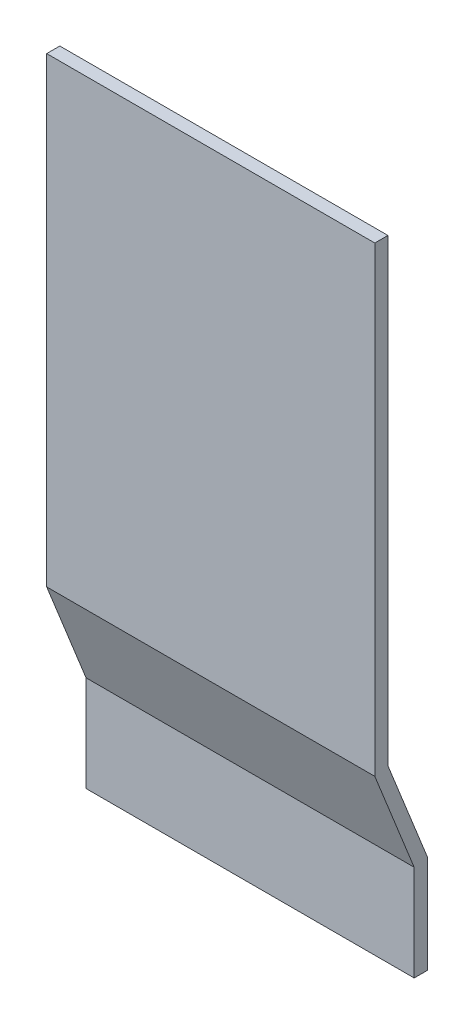
ISO-10303-21;
HEADER;
FILE_DESCRIPTION(('STEP AP214'),'2;1');
FILE_NAME('part.step','',(''),(''),'','','');
FILE_SCHEMA(('AUTOMOTIVE_DESIGN { 1 0 10303 214 1 1 1 1 }'));
ENDSEC;
DATA;
#1=APPLICATION_CONTEXT('core data for automotive mechanical design processes');
#2=APPLICATION_PROTOCOL_DEFINITION('international standard','automotive_design',2000,#1);
#3=PRODUCT_CONTEXT('',#1,'mechanical');
#4=PRODUCT('Part','Part','',(#3));
#5=PRODUCT_RELATED_PRODUCT_CATEGORY('part','',(#4));
#6=PRODUCT_DEFINITION_FORMATION('','',#4);
#7=PRODUCT_DEFINITION_CONTEXT('part definition',#1,'design');
#8=PRODUCT_DEFINITION('design','',#6,#7);
#9=PRODUCT_DEFINITION_SHAPE('','',#8);
#10=(LENGTH_UNIT() NAMED_UNIT(*) SI_UNIT(.MILLI.,.METRE.));
#11=(NAMED_UNIT(*) PLANE_ANGLE_UNIT() SI_UNIT($,.RADIAN.));
#12=(NAMED_UNIT(*) SI_UNIT($,.STERADIAN.) SOLID_ANGLE_UNIT());
#13=UNCERTAINTY_MEASURE_WITH_UNIT(LENGTH_MEASURE(1.E-05),#10,'distance_accuracy_value','');
#14=(GEOMETRIC_REPRESENTATION_CONTEXT(3) GLOBAL_UNCERTAINTY_ASSIGNED_CONTEXT((#13)) GLOBAL_UNIT_ASSIGNED_CONTEXT((#10,
#11,#12)) REPRESENTATION_CONTEXT('',''));
#15=CARTESIAN_POINT('',(0.,0.,0.));
#16=DIRECTION('',(0.,0.,1.));
#17=DIRECTION('',(1.,0.,0.));
#18=AXIS2_PLACEMENT_3D('',#15,#16,#17);
#19=CARTESIAN_POINT('',(-22.37728245926,4.697980609798,-20.53448402181));
#20=DIRECTION('',(0.,0.,1.));
#21=DIRECTION('',(0.,-1.,0.));
#22=AXIS2_PLACEMENT_3D('',#19,#20,#21);
#23=PLANE('',#22);
#24=DIRECTION('',(1.,0.,0.));
#25=VECTOR('',#24,1.);
#26=CARTESIAN_POINT('',(-22.37728245926,4.697980609798,-20.53448402181));
#27=LINE('',#26,#25);
#28=CARTESIAN_POINT('',(-24.87728245926,4.697980609798,-20.53448402181));
#29=VERTEX_POINT('',#28);
#30=CARTESIAN_POINT('',(-22.37728245926,4.697980609798,-20.53448402181));
#31=VERTEX_POINT('',#30);
#32=EDGE_CURVE('E85',#29,#31,#27,.T.);
#33=ORIENTED_EDGE('',*,*,#32,.T.);
#34=DIRECTION('',(0.,-1.,0.));
#35=VECTOR('',#34,1.);
#36=CARTESIAN_POINT('',(-22.37728245926,4.697980609798,-20.53448402181));
#37=LINE('',#36,#35);
#38=CARTESIAN_POINT('',(-22.37728245926,3.947980609798,-20.53448402181));
#39=VERTEX_POINT('',#38);
#40=EDGE_CURVE('E20',#39,#31,#37,.F.);
#41=ORIENTED_EDGE('',*,*,#40,.F.);
#42=DIRECTION('',(1.,0.,0.));
#43=VECTOR('',#42,1.);
#44=CARTESIAN_POINT('',(-22.37728245926,3.947980609798,-20.53448402181));
#45=LINE('',#44,#43);
#46=CARTESIAN_POINT('',(-24.87728245926,3.947980609798,-20.53448402181));
#47=VERTEX_POINT('',#46);
#48=EDGE_CURVE('E83',#39,#47,#45,.F.);
#49=ORIENTED_EDGE('',*,*,#48,.T.);
#50=DIRECTION('',(0.,-1.,0.));
#51=VECTOR('',#50,1.);
#52=CARTESIAN_POINT('',(-24.87728245926,4.697980609798,-20.53448402181));
#53=LINE('',#52,#51);
#54=EDGE_CURVE('E76',#29,#47,#53,.T.);
#55=ORIENTED_EDGE('',*,*,#54,.F.);
#56=EDGE_LOOP('',(#33,#41,#49,#55));
#57=FACE_BOUND('',#56,.T.);
#58=ADVANCED_FACE('F17',(#57),#23,.F.);
#59=CARTESIAN_POINT('',(-22.37728245926,3.947980609798,-20.53448402181));
#60=DIRECTION('',(0.,1.,0.));
#61=DIRECTION('',(0.,0.,1.));
#62=AXIS2_PLACEMENT_3D('',#59,#60,#61);
#63=PLANE('',#62);
#64=ORIENTED_EDGE('',*,*,#48,.F.);
#65=DIRECTION('',(0.,0.,1.));
#66=VECTOR('',#65,1.);
#67=CARTESIAN_POINT('',(-22.37728245926,3.947980609798,-20.53448402181));
#68=LINE('',#67,#66);
#69=CARTESIAN_POINT('',(-22.37728245926,3.947980609798,-20.43448402181));
#70=VERTEX_POINT('',#69);
#71=EDGE_CURVE('E92',#70,#39,#68,.F.);
#72=ORIENTED_EDGE('',*,*,#71,.F.);
#73=DIRECTION('',(-1.,0.,0.));
#74=VECTOR('',#73,1.);
#75=CARTESIAN_POINT('',(-22.37728245926,3.947980609798,-20.43448402181));
#76=LINE('',#75,#74);
#77=CARTESIAN_POINT('',(-24.87728245926,3.947980609798,-20.43448402181));
#78=VERTEX_POINT('',#77);
#79=EDGE_CURVE('E108',#70,#78,#76,.T.);
#80=ORIENTED_EDGE('',*,*,#79,.T.);
#81=DIRECTION('',(0.,0.,1.));
#82=VECTOR('',#81,1.);
#83=CARTESIAN_POINT('',(-24.87728245926,3.947980609798,-20.53448402181));
#84=LINE('',#83,#82);
#85=EDGE_CURVE('E94',#47,#78,#84,.T.);
#86=ORIENTED_EDGE('',*,*,#85,.F.);
#87=EDGE_LOOP('',(#64,#72,#80,#86));
#88=FACE_BOUND('',#87,.T.);
#89=ADVANCED_FACE('F90',(#88),#63,.F.);
#90=CARTESIAN_POINT('',(-22.37728245926,5.447980609798,-20.23448402181));
#91=DIRECTION('',(0.,-0.371390676354104,0.928476690885259));
#92=DIRECTION('',(0.,-0.928476690885259,-0.371390676354104));
#93=AXIS2_PLACEMENT_3D('',#90,#91,#92);
#94=PLANE('',#93);
#95=DIRECTION('',(1.,0.,0.));
#96=VECTOR('',#95,1.);
#97=CARTESIAN_POINT('',(-22.37728245926,5.447980609798,-20.23448402181));
#98=LINE('',#97,#96);
#99=CARTESIAN_POINT('',(-24.87728245926,5.447980609798,-20.23448402181));
#100=VERTEX_POINT('',#99);
#101=CARTESIAN_POINT('',(-22.37728245926,5.447980609798,-20.23448402181));
#102=VERTEX_POINT('',#101);
#103=EDGE_CURVE('E112',#100,#102,#98,.T.);
#104=ORIENTED_EDGE('',*,*,#103,.T.);
#105=DIRECTION('',(0.,-0.928476690885259,-0.371390676354104));
#106=VECTOR('',#105,1.);
#107=CARTESIAN_POINT('',(-22.37728245926,5.447980609798,-20.23448402181));
#108=LINE('',#107,#106);
#109=EDGE_CURVE('E104',#31,#102,#108,.F.);
#110=ORIENTED_EDGE('',*,*,#109,.F.);
#111=ORIENTED_EDGE('',*,*,#32,.F.);
#112=DIRECTION('',(0.,-0.928476690885259,-0.371390676354104));
#113=VECTOR('',#112,1.);
#114=CARTESIAN_POINT('',(-24.87728245926,5.447980609798,-20.23448402181));
#115=LINE('',#114,#113);
#116=EDGE_CURVE('E106',#100,#29,#115,.T.);
#117=ORIENTED_EDGE('',*,*,#116,.F.);
#118=EDGE_LOOP('',(#104,#110,#111,#117));
#119=FACE_BOUND('',#118,.T.);
#120=ADVANCED_FACE('F177',(#119),#94,.F.);
#121=CARTESIAN_POINT('',(-22.37728245926,4.678722369441,-20.43448402181));
#122=DIRECTION('',(0.,0.,-1.));
#123=DIRECTION('',(-1.,0.,0.));
#124=AXIS2_PLACEMENT_3D('',#121,#122,#123);
#125=PLANE('',#124);
#126=ORIENTED_EDGE('',*,*,#79,.F.);
#127=DIRECTION('',(0.,1.,0.));
#128=VECTOR('',#127,1.);
#129=CARTESIAN_POINT('',(-22.37728245926,8.947980609798,-20.43448402181));
#130=LINE('',#129,#128);
#131=CARTESIAN_POINT('',(-22.37728245926,4.678722369441,-20.43448402181));
#132=VERTEX_POINT('',#131);
#133=EDGE_CURVE('E99',#132,#70,#130,.F.);
#134=ORIENTED_EDGE('',*,*,#133,.F.);
#135=DIRECTION('',(1.,0.,0.));
#136=VECTOR('',#135,1.);
#137=CARTESIAN_POINT('',(-22.37728245926,4.678722369441,-20.43448402181));
#138=LINE('',#137,#136);
#139=CARTESIAN_POINT('',(-24.87728245926,4.678722369441,-20.43448402181));
#140=VERTEX_POINT('',#139);
#141=EDGE_CURVE('E125',#132,#140,#138,.F.);
#142=ORIENTED_EDGE('',*,*,#141,.T.);
#143=DIRECTION('',(0.,1.,0.));
#144=VECTOR('',#143,1.);
#145=CARTESIAN_POINT('',(-24.87728245926,4.678722369441,-20.43448402181));
#146=LINE('',#145,#144);
#147=EDGE_CURVE('E110',#78,#140,#146,.T.);
#148=ORIENTED_EDGE('',*,*,#147,.F.);
#149=EDGE_LOOP('',(#126,#134,#142,#148));
#150=FACE_BOUND('',#149,.T.);
#151=ADVANCED_FACE('F173',(#150),#125,.F.);
#152=CARTESIAN_POINT('',(-22.37728245926,8.947980609798,-20.23448402181));
#153=DIRECTION('',(0.,0.,1.));
#154=DIRECTION('',(0.,-1.,0.));
#155=AXIS2_PLACEMENT_3D('',#152,#153,#154);
#156=PLANE('',#155);
#157=DIRECTION('',(1.,0.,0.));
#158=VECTOR('',#157,1.);
#159=CARTESIAN_POINT('',(-22.37728245926,8.947980609798,-20.23448402181));
#160=LINE('',#159,#158);
#161=CARTESIAN_POINT('',(-24.87728245926,8.947980609798,-20.23448402181));
#162=VERTEX_POINT('',#161);
#163=CARTESIAN_POINT('',(-22.37728245926,8.947980609798,-20.23448402181));
#164=VERTEX_POINT('',#163);
#165=EDGE_CURVE('E115',#162,#164,#160,.T.);
#166=ORIENTED_EDGE('',*,*,#165,.T.);
#167=DIRECTION('',(0.,1.,0.));
#168=VECTOR('',#167,1.);
#169=CARTESIAN_POINT('',(-22.37728245926,8.947980609798,-20.23448402181));
#170=LINE('',#169,#168);
#171=EDGE_CURVE('E120',#102,#164,#170,.T.);
#172=ORIENTED_EDGE('',*,*,#171,.F.);
#173=ORIENTED_EDGE('',*,*,#103,.F.);
#174=DIRECTION('',(0.,1.,0.));
#175=VECTOR('',#174,1.);
#176=CARTESIAN_POINT('',(-24.87728245926,8.947980609798,-20.23448402181));
#177=LINE('',#176,#175);
#178=EDGE_CURVE('E129',#100,#162,#177,.T.);
#179=ORIENTED_EDGE('',*,*,#178,.T.);
#180=EDGE_LOOP('',(#166,#172,#173,#179));
#181=FACE_BOUND('',#180,.T.);
#182=ADVANCED_FACE('F170',(#181),#156,.F.);
#183=CARTESIAN_POINT('',(-22.37728245926,8.947980609798,-20.23448402181));
#184=DIRECTION('',(0.,-1.,0.));
#185=DIRECTION('',(0.,0.,-1.));
#186=AXIS2_PLACEMENT_3D('',#183,#184,#185);
#187=PLANE('',#186);
#188=DIRECTION('',(-1.,0.,0.));
#189=VECTOR('',#188,1.);
#190=CARTESIAN_POINT('',(-22.37728245926,8.947980609798,-20.13448402181));
#191=LINE('',#190,#189);
#192=CARTESIAN_POINT('',(-24.87728245926,8.947980609798,-20.13448402181));
#193=VERTEX_POINT('',#192);
#194=CARTESIAN_POINT('',(-22.37728245926,8.947980609798,-20.13448402181));
#195=VERTEX_POINT('',#194);
#196=EDGE_CURVE('E135',#193,#195,#191,.F.);
#197=ORIENTED_EDGE('',*,*,#196,.T.);
#198=DIRECTION('',(0.,0.,-1.));
#199=VECTOR('',#198,1.);
#200=CARTESIAN_POINT('',(-22.37728245926,8.947980609798,-20.13448402181));
#201=LINE('',#200,#199);
#202=EDGE_CURVE('E117',#164,#195,#201,.F.);
#203=ORIENTED_EDGE('',*,*,#202,.F.);
#204=ORIENTED_EDGE('',*,*,#165,.F.);
#205=DIRECTION('',(0.,0.,-1.));
#206=VECTOR('',#205,1.);
#207=CARTESIAN_POINT('',(-24.87728245926,8.947980609798,-20.13448402181));
#208=LINE('',#207,#206);
#209=EDGE_CURVE('E132',#162,#193,#208,.F.);
#210=ORIENTED_EDGE('',*,*,#209,.T.);
#211=EDGE_LOOP('',(#197,#203,#204,#210));
#212=FACE_BOUND('',#211,.T.);
#213=ADVANCED_FACE('F152',(#212),#187,.F.);
#214=CARTESIAN_POINT('',(-22.37728245926,8.947980609798,-20.13448402181));
#215=DIRECTION('',(1.,0.,0.));
#216=DIRECTION('',(0.,0.,-1.));
#217=AXIS2_PLACEMENT_3D('',#214,#215,#216);
#218=PLANE('',#217);
#219=ORIENTED_EDGE('',*,*,#109,.T.);
#220=ORIENTED_EDGE('',*,*,#171,.T.);
#221=ORIENTED_EDGE('',*,*,#202,.T.);
#222=DIRECTION('',(0.,1.,0.));
#223=VECTOR('',#222,1.);
#224=CARTESIAN_POINT('',(-22.37728245926,8.947980609798,-20.13448402181));
#225=LINE('',#224,#223);
#226=CARTESIAN_POINT('',(-22.37728245926,5.428722369441,-20.13448402181));
#227=VERTEX_POINT('',#226);
#228=EDGE_CURVE('E138',#195,#227,#225,.F.);
#229=ORIENTED_EDGE('',*,*,#228,.T.);
#230=DIRECTION('',(0.,0.928476690885259,0.371390676354104));
#231=VECTOR('',#230,1.);
#232=CARTESIAN_POINT('',(-22.37728245926,5.428722369441,-20.13448402181));
#233=LINE('',#232,#231);
#234=EDGE_CURVE('E123',#227,#132,#233,.F.);
#235=ORIENTED_EDGE('',*,*,#234,.T.);
#236=ORIENTED_EDGE('',*,*,#133,.T.);
#237=ORIENTED_EDGE('',*,*,#71,.T.);
#238=ORIENTED_EDGE('',*,*,#40,.T.);
#239=EDGE_LOOP('',(#219,#220,#221,#229,#235,#236,#237,#238));
#240=FACE_BOUND('',#239,.T.);
#241=ADVANCED_FACE('F97',(#240),#218,.T.);
#242=CARTESIAN_POINT('',(-22.37728245926,5.428722369441,-20.13448402181));
#243=DIRECTION('',(0.,0.371390676354104,-0.928476690885259));
#244=DIRECTION('',(0.,0.928476690885259,0.371390676354104));
#245=AXIS2_PLACEMENT_3D('',#242,#243,#244);
#246=PLANE('',#245);
#247=ORIENTED_EDGE('',*,*,#141,.F.);
#248=ORIENTED_EDGE('',*,*,#234,.F.);
#249=DIRECTION('',(-1.,0.,0.));
#250=VECTOR('',#249,1.);
#251=CARTESIAN_POINT('',(-22.37728245926,5.428722369441,-20.13448402181));
#252=LINE('',#251,#250);
#253=CARTESIAN_POINT('',(-24.87728245926,5.428722369441,-20.13448402181));
#254=VERTEX_POINT('',#253);
#255=EDGE_CURVE('E26',#227,#254,#252,.T.);
#256=ORIENTED_EDGE('',*,*,#255,.T.);
#257=DIRECTION('',(0.,-0.928476690885259,-0.371390676354106));
#258=VECTOR('',#257,1.);
#259=CARTESIAN_POINT('',(-24.87728245926,5.428722369441,-20.13448402181));
#260=LINE('',#259,#258);
#261=EDGE_CURVE('E34',#254,#140,#260,.T.);
#262=ORIENTED_EDGE('',*,*,#261,.T.);
#263=EDGE_LOOP('',(#247,#248,#256,#262));
#264=FACE_BOUND('',#263,.T.);
#265=ADVANCED_FACE('F145',(#264),#246,.F.);
#266=CARTESIAN_POINT('',(-24.87728245926,8.947980609798,-20.13448402181));
#267=DIRECTION('',(1.,0.,0.));
#268=DIRECTION('',(0.,0.,-1.));
#269=AXIS2_PLACEMENT_3D('',#266,#267,#268);
#270=PLANE('',#269);
#271=ORIENTED_EDGE('',*,*,#178,.F.);
#272=ORIENTED_EDGE('',*,*,#116,.T.);
#273=ORIENTED_EDGE('',*,*,#54,.T.);
#274=ORIENTED_EDGE('',*,*,#85,.T.);
#275=ORIENTED_EDGE('',*,*,#147,.T.);
#276=ORIENTED_EDGE('',*,*,#261,.F.);
#277=DIRECTION('',(0.,1.,0.));
#278=VECTOR('',#277,1.);
#279=CARTESIAN_POINT('',(-24.87728245926,8.947980609798,-20.13448402181));
#280=LINE('',#279,#278);
#281=EDGE_CURVE('E11',#254,#193,#280,.T.);
#282=ORIENTED_EDGE('',*,*,#281,.T.);
#283=ORIENTED_EDGE('',*,*,#209,.F.);
#284=EDGE_LOOP('',(#271,#272,#273,#274,#275,#276,#282,#283));
#285=FACE_BOUND('',#284,.T.);
#286=ADVANCED_FACE('F155',(#285),#270,.F.);
#287=CARTESIAN_POINT('',(-22.37728245926,8.947980609798,-20.13448402181));
#288=DIRECTION('',(0.,0.,-1.));
#289=DIRECTION('',(-1.,0.,0.));
#290=AXIS2_PLACEMENT_3D('',#287,#288,#289);
#291=PLANE('',#290);
#292=ORIENTED_EDGE('',*,*,#255,.F.);
#293=ORIENTED_EDGE('',*,*,#228,.F.);
#294=ORIENTED_EDGE('',*,*,#196,.F.);
#295=ORIENTED_EDGE('',*,*,#281,.F.);
#296=EDGE_LOOP('',(#292,#293,#294,#295));
#297=FACE_BOUND('',#296,.T.);
#298=ADVANCED_FACE('F148',(#297),#291,.F.);
#299=CLOSED_SHELL('',(#58,#89,#120,#151,#182,#213,#241,#265,#286,#298));
#300=MANIFOLD_SOLID_BREP('B1',#299);
#301=ADVANCED_BREP_SHAPE_REPRESENTATION('',(#18,#300),#14);
#302=SHAPE_DEFINITION_REPRESENTATION(#9,#301);
ENDSEC;
END-ISO-10303-21;
